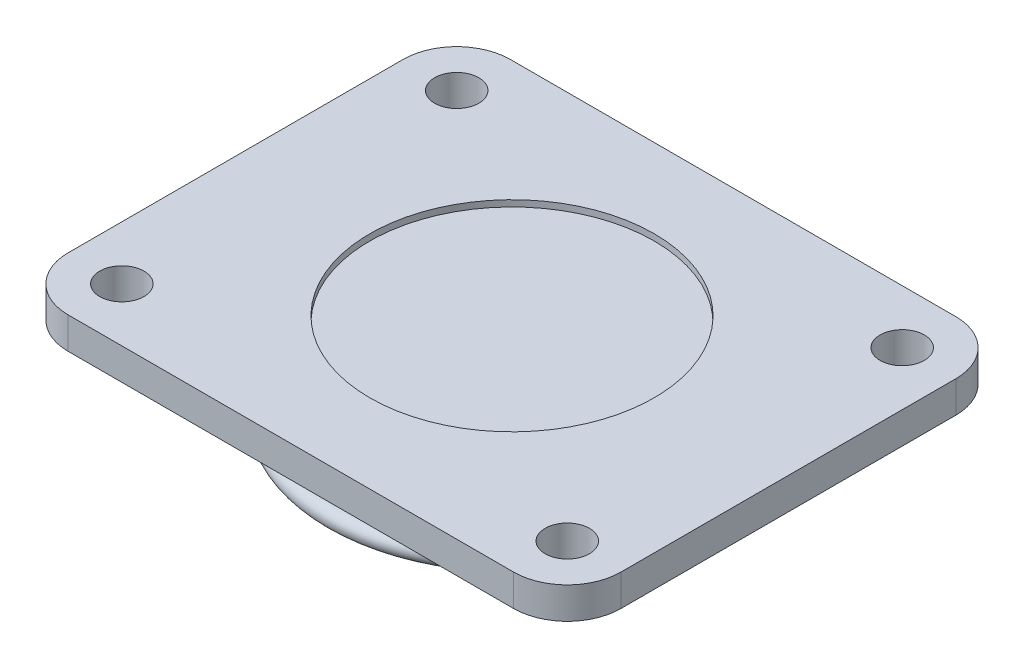
ISO-10303-21;
HEADER;
FILE_DESCRIPTION(('STEP AP214'),'2;1');
FILE_NAME('part.step','',(''),(''),'','','');
FILE_SCHEMA(('AUTOMOTIVE_DESIGN { 1 0 10303 214 1 1 1 1 }'));
ENDSEC;
DATA;
#1=APPLICATION_CONTEXT('core data for automotive mechanical design processes');
#2=APPLICATION_PROTOCOL_DEFINITION('international standard','automotive_design',2000,#1);
#3=PRODUCT_CONTEXT('',#1,'mechanical');
#4=PRODUCT('Part','Part','',(#3));
#5=PRODUCT_RELATED_PRODUCT_CATEGORY('part','',(#4));
#6=PRODUCT_DEFINITION_FORMATION('','',#4);
#7=PRODUCT_DEFINITION_CONTEXT('part definition',#1,'design');
#8=PRODUCT_DEFINITION('design','',#6,#7);
#9=PRODUCT_DEFINITION_SHAPE('','',#8);
#10=(LENGTH_UNIT() NAMED_UNIT(*) SI_UNIT(.MILLI.,.METRE.));
#11=(NAMED_UNIT(*) PLANE_ANGLE_UNIT() SI_UNIT($,.RADIAN.));
#12=(NAMED_UNIT(*) SI_UNIT($,.STERADIAN.) SOLID_ANGLE_UNIT());
#13=UNCERTAINTY_MEASURE_WITH_UNIT(LENGTH_MEASURE(1.E-05),#10,'distance_accuracy_value','');
#14=(GEOMETRIC_REPRESENTATION_CONTEXT(3) GLOBAL_UNCERTAINTY_ASSIGNED_CONTEXT((#13)) GLOBAL_UNIT_ASSIGNED_CONTEXT((#10,
#11,#12)) REPRESENTATION_CONTEXT('',''));
#15=CARTESIAN_POINT('',(0.,0.,0.));
#16=DIRECTION('',(0.,0.,1.));
#17=DIRECTION('',(1.,0.,0.));
#18=AXIS2_PLACEMENT_3D('',#15,#16,#17);
#19=CARTESIAN_POINT('',(13.1976,-0.267260409429404,-9.9216));
#20=DIRECTION('',(0.,-1.,0.));
#21=DIRECTION('',(0.,0.,-1.));
#22=AXIS2_PLACEMENT_3D('',#19,#20,#21);
#23=PLANE('',#22);
#24=CARTESIAN_POINT('',(0.,-0.267260409429404,0.));
#25=DIRECTION('',(0.,1.,0.));
#26=DIRECTION('',(0.,0.,1.));
#27=AXIS2_PLACEMENT_3D('',#24,#25,#26);
#28=CIRCLE('',#27,8.424);
#29=CARTESIAN_POINT('',(0.,-0.267260409429404,8.424));
#30=VERTEX_POINT('',#29);
#31=EDGE_CURVE('E289',#30,#30,#28,.T.);
#32=ORIENTED_EDGE('',*,*,#31,.F.);
#33=EDGE_LOOP('',(#32));
#34=FACE_BOUND('',#33,.T.);
#35=CARTESIAN_POINT('',(13.1976,-0.267260409429404,-9.9216));
#36=DIRECTION('',(0.,1.,0.));
#37=DIRECTION('',(0.,0.,-1.));
#38=AXIS2_PLACEMENT_3D('',#35,#36,#37);
#39=CIRCLE('',#38,3.1824);
#40=CARTESIAN_POINT('',(16.38,-0.267260409429404,-9.92159999999998));
#41=VERTEX_POINT('',#40);
#42=CARTESIAN_POINT('',(13.1976,-0.267260409429404,-13.104));
#43=VERTEX_POINT('',#42);
#44=EDGE_CURVE('E164',#41,#43,#39,.T.);
#45=ORIENTED_EDGE('',*,*,#44,.T.);
#46=DIRECTION('',(-1.,0.,0.));
#47=VECTOR('',#46,1.);
#48=CARTESIAN_POINT('',(-13.1976,-0.267260409429404,-13.104));
#49=LINE('',#48,#47);
#50=CARTESIAN_POINT('',(-13.1976,-0.267260409429404,-13.104));
#51=VERTEX_POINT('',#50);
#52=EDGE_CURVE('E112',#43,#51,#49,.T.);
#53=ORIENTED_EDGE('',*,*,#52,.T.);
#54=CARTESIAN_POINT('',(-13.1976,-0.267260409429404,-9.9216));
#55=DIRECTION('',(0.,1.,0.));
#56=DIRECTION('',(0.,0.,-1.));
#57=AXIS2_PLACEMENT_3D('',#54,#55,#56);
#58=CIRCLE('',#57,3.1824);
#59=CARTESIAN_POINT('',(-16.38,-0.267260409429404,-9.92159999999998));
#60=VERTEX_POINT('',#59);
#61=EDGE_CURVE('E245',#51,#60,#58,.T.);
#62=ORIENTED_EDGE('',*,*,#61,.T.);
#63=DIRECTION('',(0.,0.,1.));
#64=VECTOR('',#63,1.);
#65=CARTESIAN_POINT('',(-16.38,-0.267260409429404,9.92159999999998));
#66=LINE('',#65,#64);
#67=CARTESIAN_POINT('',(-16.38,-0.267260409429404,9.92159999999998));
#68=VERTEX_POINT('',#67);
#69=EDGE_CURVE('E247',#60,#68,#66,.T.);
#70=ORIENTED_EDGE('',*,*,#69,.T.);
#71=CARTESIAN_POINT('',(-13.1976,-0.267260409429404,9.9216));
#72=DIRECTION('',(0.,1.,0.));
#73=DIRECTION('',(0.,0.,-1.));
#74=AXIS2_PLACEMENT_3D('',#71,#72,#73);
#75=CIRCLE('',#74,3.1824);
#76=CARTESIAN_POINT('',(-13.1976,-0.267260409429404,13.104));
#77=VERTEX_POINT('',#76);
#78=EDGE_CURVE('E131',#68,#77,#75,.T.);
#79=ORIENTED_EDGE('',*,*,#78,.T.);
#80=DIRECTION('',(1.,0.,0.));
#81=VECTOR('',#80,1.);
#82=CARTESIAN_POINT('',(-13.1976,-0.267260409429404,13.104));
#83=LINE('',#82,#81);
#84=CARTESIAN_POINT('',(13.1976,-0.267260409429404,13.104));
#85=VERTEX_POINT('',#84);
#86=EDGE_CURVE('E125',#77,#85,#83,.T.);
#87=ORIENTED_EDGE('',*,*,#86,.T.);
#88=CARTESIAN_POINT('',(13.1976,-0.267260409429404,9.9216));
#89=DIRECTION('',(0.,1.,0.));
#90=DIRECTION('',(0.,0.,1.));
#91=AXIS2_PLACEMENT_3D('',#88,#89,#90);
#92=CIRCLE('',#91,3.1824);
#93=CARTESIAN_POINT('',(16.38,-0.267260409429404,9.92159999999998));
#94=VERTEX_POINT('',#93);
#95=EDGE_CURVE('E129',#85,#94,#92,.T.);
#96=ORIENTED_EDGE('',*,*,#95,.T.);
#97=DIRECTION('',(0.,0.,-1.));
#98=VECTOR('',#97,1.);
#99=CARTESIAN_POINT('',(16.38,-0.267260409429404,9.92159999999998));
#100=LINE('',#99,#98);
#101=EDGE_CURVE('E68',#94,#41,#100,.T.);
#102=ORIENTED_EDGE('',*,*,#101,.T.);
#103=EDGE_LOOP('',(#45,#53,#62,#70,#79,#87,#96,#102));
#104=FACE_BOUND('',#103,.T.);
#105=CARTESIAN_POINT('',(-13.1976,-0.267260409429404,-9.9216));
#106=DIRECTION('',(0.,1.,0.));
#107=DIRECTION('',(0.,0.,1.));
#108=AXIS2_PLACEMENT_3D('',#105,#106,#107);
#109=CIRCLE('',#108,1.3104);
#110=CARTESIAN_POINT('',(-13.1976,-0.267260409429404,-8.6112));
#111=VERTEX_POINT('',#110);
#112=EDGE_CURVE('E153',#111,#111,#109,.T.);
#113=ORIENTED_EDGE('',*,*,#112,.F.);
#114=EDGE_LOOP('',(#113));
#115=FACE_BOUND('',#114,.T.);
#116=CARTESIAN_POINT('',(-13.1976,-0.267260409429404,9.9216));
#117=DIRECTION('',(0.,1.,0.));
#118=DIRECTION('',(0.,0.,1.));
#119=AXIS2_PLACEMENT_3D('',#116,#117,#118);
#120=CIRCLE('',#119,1.3104);
#121=CARTESIAN_POINT('',(-13.1976,-0.267260409429404,11.232));
#122=VERTEX_POINT('',#121);
#123=EDGE_CURVE('E256',#122,#122,#120,.T.);
#124=ORIENTED_EDGE('',*,*,#123,.F.);
#125=EDGE_LOOP('',(#124));
#126=FACE_BOUND('',#125,.T.);
#127=CARTESIAN_POINT('',(13.1976,-0.267260409429404,9.9216));
#128=DIRECTION('',(0.,1.,0.));
#129=DIRECTION('',(0.,0.,1.));
#130=AXIS2_PLACEMENT_3D('',#127,#128,#129);
#131=CIRCLE('',#130,1.3104);
#132=CARTESIAN_POINT('',(13.1976,-0.267260409429404,11.232));
#133=VERTEX_POINT('',#132);
#134=EDGE_CURVE('E262',#133,#133,#131,.T.);
#135=ORIENTED_EDGE('',*,*,#134,.F.);
#136=EDGE_LOOP('',(#135));
#137=FACE_BOUND('',#136,.T.);
#138=CARTESIAN_POINT('',(13.1976,-0.267260409429404,-9.9216));
#139=DIRECTION('',(0.,1.,0.));
#140=DIRECTION('',(0.,0.,1.));
#141=AXIS2_PLACEMENT_3D('',#138,#139,#140);
#142=CIRCLE('',#141,1.3104);
#143=CARTESIAN_POINT('',(13.1976,-0.267260409429404,-8.6112));
#144=VERTEX_POINT('',#143);
#145=EDGE_CURVE('E268',#144,#144,#142,.T.);
#146=ORIENTED_EDGE('',*,*,#145,.F.);
#147=EDGE_LOOP('',(#146));
#148=FACE_BOUND('',#147,.T.);
#149=ADVANCED_FACE('F51',(#34,#104,#115,#126,#137,#148),#23,.F.);
#150=CARTESIAN_POINT('',(13.1976,-2.1392604094294,-9.9216));
#151=DIRECTION('',(0.,-1.,0.));
#152=DIRECTION('',(0.,0.,-1.));
#153=AXIS2_PLACEMENT_3D('',#150,#151,#152);
#154=PLANE('',#153);
#155=CARTESIAN_POINT('',(0.,-2.1392604094294,0.));
#156=DIRECTION('',(0.,-1.,0.));
#157=DIRECTION('',(0.,0.,-1.));
#158=AXIS2_PLACEMENT_3D('',#155,#156,#157);
#159=CIRCLE('',#158,10.4832);
#160=CARTESIAN_POINT('',(0.,-2.1392604094294,-10.4832));
#161=VERTEX_POINT('',#160);
#162=EDGE_CURVE('E274',#161,#161,#159,.T.);
#163=ORIENTED_EDGE('',*,*,#162,.F.);
#164=EDGE_LOOP('',(#163));
#165=FACE_BOUND('',#164,.T.);
#166=CARTESIAN_POINT('',(13.1976,-2.1392604094294,9.9216));
#167=DIRECTION('',(0.,1.,0.));
#168=DIRECTION('',(0.,0.,1.));
#169=AXIS2_PLACEMENT_3D('',#166,#167,#168);
#170=CIRCLE('',#169,1.3104);
#171=CARTESIAN_POINT('',(13.1976,-2.1392604094294,11.232));
#172=VERTEX_POINT('',#171);
#173=EDGE_CURVE('E265',#172,#172,#170,.T.);
#174=ORIENTED_EDGE('',*,*,#173,.T.);
#175=EDGE_LOOP('',(#174));
#176=FACE_BOUND('',#175,.T.);
#177=CARTESIAN_POINT('',(-13.1976,-2.1392604094294,-9.9216));
#178=DIRECTION('',(0.,1.,0.));
#179=DIRECTION('',(0.,0.,1.));
#180=AXIS2_PLACEMENT_3D('',#177,#178,#179);
#181=CIRCLE('',#180,1.3104);
#182=CARTESIAN_POINT('',(-13.1976,-2.1392604094294,-8.6112));
#183=VERTEX_POINT('',#182);
#184=EDGE_CURVE('E253',#183,#183,#181,.T.);
#185=ORIENTED_EDGE('',*,*,#184,.T.);
#186=EDGE_LOOP('',(#185));
#187=FACE_BOUND('',#186,.T.);
#188=CARTESIAN_POINT('',(13.1976,-2.1392604094294,-9.9216));
#189=DIRECTION('',(0.,1.,0.));
#190=DIRECTION('',(0.,0.,-1.));
#191=AXIS2_PLACEMENT_3D('',#188,#189,#190);
#192=CIRCLE('',#191,3.1824);
#193=CARTESIAN_POINT('',(16.38,-2.1392604094294,-9.92159999999998));
#194=VERTEX_POINT('',#193);
#195=CARTESIAN_POINT('',(13.1976,-2.1392604094294,-13.104));
#196=VERTEX_POINT('',#195);
#197=EDGE_CURVE('E149',#194,#196,#192,.T.);
#198=ORIENTED_EDGE('',*,*,#197,.F.);
#199=DIRECTION('',(0.,0.,-1.));
#200=VECTOR('',#199,1.);
#201=CARTESIAN_POINT('',(16.38,-2.1392604094294,9.92159999999998));
#202=LINE('',#201,#200);
#203=CARTESIAN_POINT('',(16.38,-2.1392604094294,9.92159999999998));
#204=VERTEX_POINT('',#203);
#205=EDGE_CURVE('E103',#204,#194,#202,.T.);
#206=ORIENTED_EDGE('',*,*,#205,.F.);
#207=CARTESIAN_POINT('',(13.1976,-2.1392604094294,9.9216));
#208=DIRECTION('',(0.,1.,0.));
#209=DIRECTION('',(0.,0.,1.));
#210=AXIS2_PLACEMENT_3D('',#207,#208,#209);
#211=CIRCLE('',#210,3.1824);
#212=CARTESIAN_POINT('',(13.1976,-2.1392604094294,13.104));
#213=VERTEX_POINT('',#212);
#214=EDGE_CURVE('E97',#213,#204,#211,.T.);
#215=ORIENTED_EDGE('',*,*,#214,.F.);
#216=DIRECTION('',(1.,0.,0.));
#217=VECTOR('',#216,1.);
#218=CARTESIAN_POINT('',(-13.1976,-2.1392604094294,13.104));
#219=LINE('',#218,#217);
#220=CARTESIAN_POINT('',(-13.1976,-2.1392604094294,13.104));
#221=VERTEX_POINT('',#220);
#222=EDGE_CURVE('E139',#221,#213,#219,.T.);
#223=ORIENTED_EDGE('',*,*,#222,.F.);
#224=CARTESIAN_POINT('',(-13.1976,-2.1392604094294,9.9216));
#225=DIRECTION('',(0.,1.,0.));
#226=DIRECTION('',(0.,0.,-1.));
#227=AXIS2_PLACEMENT_3D('',#224,#225,#226);
#228=CIRCLE('',#227,3.1824);
#229=CARTESIAN_POINT('',(-16.38,-2.1392604094294,9.92159999999998));
#230=VERTEX_POINT('',#229);
#231=EDGE_CURVE('E159',#230,#221,#228,.T.);
#232=ORIENTED_EDGE('',*,*,#231,.F.);
#233=DIRECTION('',(0.,0.,1.));
#234=VECTOR('',#233,1.);
#235=CARTESIAN_POINT('',(-16.38,-2.1392604094294,9.92159999999998));
#236=LINE('',#235,#234);
#237=CARTESIAN_POINT('',(-16.38,-2.1392604094294,-9.92159999999998));
#238=VERTEX_POINT('',#237);
#239=EDGE_CURVE('E157',#238,#230,#236,.T.);
#240=ORIENTED_EDGE('',*,*,#239,.F.);
#241=CARTESIAN_POINT('',(-13.1976,-2.1392604094294,-9.9216));
#242=DIRECTION('',(0.,1.,0.));
#243=DIRECTION('',(0.,0.,-1.));
#244=AXIS2_PLACEMENT_3D('',#241,#242,#243);
#245=CIRCLE('',#244,3.1824);
#246=CARTESIAN_POINT('',(-13.1976,-2.1392604094294,-13.104));
#247=VERTEX_POINT('',#246);
#248=EDGE_CURVE('E155',#247,#238,#245,.T.);
#249=ORIENTED_EDGE('',*,*,#248,.F.);
#250=DIRECTION('',(-1.,0.,0.));
#251=VECTOR('',#250,1.);
#252=CARTESIAN_POINT('',(-13.1976,-2.1392604094294,-13.104));
#253=LINE('',#252,#251);
#254=EDGE_CURVE('E152',#196,#247,#253,.T.);
#255=ORIENTED_EDGE('',*,*,#254,.F.);
#256=EDGE_LOOP('',(#198,#206,#215,#223,#232,#240,#249,#255));
#257=FACE_BOUND('',#256,.T.);
#258=CARTESIAN_POINT('',(-13.1976,-2.1392604094294,9.9216));
#259=DIRECTION('',(0.,1.,0.));
#260=DIRECTION('',(0.,0.,1.));
#261=AXIS2_PLACEMENT_3D('',#258,#259,#260);
#262=CIRCLE('',#261,1.3104);
#263=CARTESIAN_POINT('',(-13.1976,-2.1392604094294,11.232));
#264=VERTEX_POINT('',#263);
#265=EDGE_CURVE('E259',#264,#264,#262,.T.);
#266=ORIENTED_EDGE('',*,*,#265,.T.);
#267=EDGE_LOOP('',(#266));
#268=FACE_BOUND('',#267,.T.);
#269=CARTESIAN_POINT('',(13.1976,-2.1392604094294,-9.9216));
#270=DIRECTION('',(0.,1.,0.));
#271=DIRECTION('',(0.,0.,1.));
#272=AXIS2_PLACEMENT_3D('',#269,#270,#271);
#273=CIRCLE('',#272,1.3104);
#274=CARTESIAN_POINT('',(13.1976,-2.1392604094294,-8.6112));
#275=VERTEX_POINT('',#274);
#276=EDGE_CURVE('E271',#275,#275,#273,.T.);
#277=ORIENTED_EDGE('',*,*,#276,.T.);
#278=EDGE_LOOP('',(#277));
#279=FACE_BOUND('',#278,.T.);
#280=ADVANCED_FACE('F197',(#165,#176,#187,#257,#268,#279),#154,.T.);
#281=CARTESIAN_POINT('',(13.1976,-0.267260409429404,-9.9216));
#282=DIRECTION('',(0.,-1.,0.));
#283=DIRECTION('',(0.,0.,-1.));
#284=AXIS2_PLACEMENT_3D('',#281,#282,#283);
#285=CYLINDRICAL_SURFACE('',#284,3.1824);
#286=ORIENTED_EDGE('',*,*,#197,.T.);
#287=DIRECTION('',(0.,-1.,0.));
#288=VECTOR('',#287,1.);
#289=CARTESIAN_POINT('',(13.1976,-0.267260409429404,-13.104));
#290=LINE('',#289,#288);
#291=EDGE_CURVE('E177',#43,#196,#290,.T.);
#292=ORIENTED_EDGE('',*,*,#291,.F.);
#293=ORIENTED_EDGE('',*,*,#44,.F.);
#294=DIRECTION('',(0.,-1.,0.));
#295=VECTOR('',#294,1.);
#296=CARTESIAN_POINT('',(16.38,-0.267260409429404,-9.92159999999998));
#297=LINE('',#296,#295);
#298=EDGE_CURVE('E145',#41,#194,#297,.T.);
#299=ORIENTED_EDGE('',*,*,#298,.T.);
#300=EDGE_LOOP('',(#286,#292,#293,#299));
#301=FACE_BOUND('',#300,.T.);
#302=ADVANCED_FACE('F203',(#301),#285,.T.);
#303=CARTESIAN_POINT('',(-13.1976,-0.267260409429404,-13.104));
#304=DIRECTION('',(0.,0.,1.));
#305=DIRECTION('',(1.,0.,0.));
#306=AXIS2_PLACEMENT_3D('',#303,#304,#305);
#307=PLANE('',#306);
#308=ORIENTED_EDGE('',*,*,#254,.T.);
#309=DIRECTION('',(0.,-1.,0.));
#310=VECTOR('',#309,1.);
#311=CARTESIAN_POINT('',(-13.1976,-0.267260409429404,-13.104));
#312=LINE('',#311,#310);
#313=EDGE_CURVE('E174',#51,#247,#312,.T.);
#314=ORIENTED_EDGE('',*,*,#313,.F.);
#315=ORIENTED_EDGE('',*,*,#52,.F.);
#316=ORIENTED_EDGE('',*,*,#291,.T.);
#317=EDGE_LOOP('',(#308,#314,#315,#316));
#318=FACE_BOUND('',#317,.T.);
#319=ADVANCED_FACE('F229',(#318),#307,.F.);
#320=CARTESIAN_POINT('',(-13.1976,-0.267260409429404,-9.9216));
#321=DIRECTION('',(0.,-1.,0.));
#322=DIRECTION('',(0.,0.,-1.));
#323=AXIS2_PLACEMENT_3D('',#320,#321,#322);
#324=CYLINDRICAL_SURFACE('',#323,3.1824);
#325=ORIENTED_EDGE('',*,*,#248,.T.);
#326=DIRECTION('',(0.,-1.,0.));
#327=VECTOR('',#326,1.);
#328=CARTESIAN_POINT('',(-16.38,-0.267260409429404,-9.92159999999998));
#329=LINE('',#328,#327);
#330=EDGE_CURVE('E171',#60,#238,#329,.T.);
#331=ORIENTED_EDGE('',*,*,#330,.F.);
#332=ORIENTED_EDGE('',*,*,#61,.F.);
#333=ORIENTED_EDGE('',*,*,#313,.T.);
#334=EDGE_LOOP('',(#325,#331,#332,#333));
#335=FACE_BOUND('',#334,.T.);
#336=ADVANCED_FACE('F225',(#335),#324,.T.);
#337=CARTESIAN_POINT('',(-16.38,-0.267260409429404,9.92159999999998));
#338=DIRECTION('',(1.,0.,0.));
#339=DIRECTION('',(0.,0.,-1.));
#340=AXIS2_PLACEMENT_3D('',#337,#338,#339);
#341=PLANE('',#340);
#342=ORIENTED_EDGE('',*,*,#239,.T.);
#343=DIRECTION('',(0.,-1.,0.));
#344=VECTOR('',#343,1.);
#345=CARTESIAN_POINT('',(-16.38,-0.267260409429404,9.92159999999998));
#346=LINE('',#345,#344);
#347=EDGE_CURVE('E168',#68,#230,#346,.T.);
#348=ORIENTED_EDGE('',*,*,#347,.F.);
#349=ORIENTED_EDGE('',*,*,#69,.F.);
#350=ORIENTED_EDGE('',*,*,#330,.T.);
#351=EDGE_LOOP('',(#342,#348,#349,#350));
#352=FACE_BOUND('',#351,.T.);
#353=ADVANCED_FACE('F221',(#352),#341,.F.);
#354=CARTESIAN_POINT('',(-13.1976,-0.267260409429404,9.9216));
#355=DIRECTION('',(0.,-1.,0.));
#356=DIRECTION('',(0.,0.,-1.));
#357=AXIS2_PLACEMENT_3D('',#354,#355,#356);
#358=CYLINDRICAL_SURFACE('',#357,3.1824);
#359=ORIENTED_EDGE('',*,*,#231,.T.);
#360=DIRECTION('',(0.,-1.,0.));
#361=VECTOR('',#360,1.);
#362=CARTESIAN_POINT('',(-13.1976,-0.267260409429404,13.104));
#363=LINE('',#362,#361);
#364=EDGE_CURVE('E140',#77,#221,#363,.T.);
#365=ORIENTED_EDGE('',*,*,#364,.F.);
#366=ORIENTED_EDGE('',*,*,#78,.F.);
#367=ORIENTED_EDGE('',*,*,#347,.T.);
#368=EDGE_LOOP('',(#359,#365,#366,#367));
#369=FACE_BOUND('',#368,.T.);
#370=ADVANCED_FACE('F218',(#369),#358,.T.);
#371=CARTESIAN_POINT('',(-13.1976,-0.267260409429404,13.104));
#372=DIRECTION('',(0.,0.,-1.));
#373=DIRECTION('',(-1.,0.,0.));
#374=AXIS2_PLACEMENT_3D('',#371,#372,#373);
#375=PLANE('',#374);
#376=ORIENTED_EDGE('',*,*,#222,.T.);
#377=DIRECTION('',(0.,-1.,0.));
#378=VECTOR('',#377,1.);
#379=CARTESIAN_POINT('',(13.1976,-0.267260409429404,13.104));
#380=LINE('',#379,#378);
#381=EDGE_CURVE('E136',#85,#213,#380,.T.);
#382=ORIENTED_EDGE('',*,*,#381,.F.);
#383=ORIENTED_EDGE('',*,*,#86,.F.);
#384=ORIENTED_EDGE('',*,*,#364,.T.);
#385=EDGE_LOOP('',(#376,#382,#383,#384));
#386=FACE_BOUND('',#385,.T.);
#387=ADVANCED_FACE('F137',(#386),#375,.F.);
#388=CARTESIAN_POINT('',(13.1976,-0.267260409429404,9.9216));
#389=DIRECTION('',(0.,-1.,0.));
#390=DIRECTION('',(0.,0.,-1.));
#391=AXIS2_PLACEMENT_3D('',#388,#389,#390);
#392=CYLINDRICAL_SURFACE('',#391,3.1824);
#393=ORIENTED_EDGE('',*,*,#214,.T.);
#394=DIRECTION('',(0.,-1.,0.));
#395=VECTOR('',#394,1.);
#396=CARTESIAN_POINT('',(16.38,-0.267260409429404,9.92159999999998));
#397=LINE('',#396,#395);
#398=EDGE_CURVE('E141',#94,#204,#397,.T.);
#399=ORIENTED_EDGE('',*,*,#398,.F.);
#400=ORIENTED_EDGE('',*,*,#95,.F.);
#401=ORIENTED_EDGE('',*,*,#381,.T.);
#402=EDGE_LOOP('',(#393,#399,#400,#401));
#403=FACE_BOUND('',#402,.T.);
#404=ADVANCED_FACE('F143',(#403),#392,.T.);
#405=CARTESIAN_POINT('',(16.38,-0.267260409429404,9.92159999999998));
#406=DIRECTION('',(-1.,0.,0.));
#407=DIRECTION('',(0.,0.,1.));
#408=AXIS2_PLACEMENT_3D('',#405,#406,#407);
#409=PLANE('',#408);
#410=ORIENTED_EDGE('',*,*,#205,.T.);
#411=ORIENTED_EDGE('',*,*,#298,.F.);
#412=ORIENTED_EDGE('',*,*,#101,.F.);
#413=ORIENTED_EDGE('',*,*,#398,.T.);
#414=EDGE_LOOP('',(#410,#411,#412,#413));
#415=FACE_BOUND('',#414,.T.);
#416=ADVANCED_FACE('F211',(#415),#409,.F.);
#417=CARTESIAN_POINT('',(-13.1976,-0.267260409429404,-9.9216));
#418=DIRECTION('',(0.,-1.,0.));
#419=DIRECTION('',(0.,0.,-1.));
#420=AXIS2_PLACEMENT_3D('',#417,#418,#419);
#421=CYLINDRICAL_SURFACE('',#420,1.3104);
#422=ORIENTED_EDGE('',*,*,#112,.T.);
#423=EDGE_LOOP('',(#422));
#424=FACE_BOUND('',#423,.T.);
#425=ORIENTED_EDGE('',*,*,#184,.F.);
#426=EDGE_LOOP('',(#425));
#427=FACE_BOUND('',#426,.T.);
#428=ADVANCED_FACE('F208',(#424,#427),#421,.F.);
#429=CARTESIAN_POINT('',(-13.1976,-0.267260409429404,9.9216));
#430=DIRECTION('',(0.,-1.,0.));
#431=DIRECTION('',(0.,0.,-1.));
#432=AXIS2_PLACEMENT_3D('',#429,#430,#431);
#433=CYLINDRICAL_SURFACE('',#432,1.3104);
#434=ORIENTED_EDGE('',*,*,#123,.T.);
#435=EDGE_LOOP('',(#434));
#436=FACE_BOUND('',#435,.T.);
#437=ORIENTED_EDGE('',*,*,#265,.F.);
#438=EDGE_LOOP('',(#437));
#439=FACE_BOUND('',#438,.T.);
#440=ADVANCED_FACE('F322',(#436,#439),#433,.F.);
#441=CARTESIAN_POINT('',(13.1976,-0.267260409429404,9.9216));
#442=DIRECTION('',(0.,-1.,0.));
#443=DIRECTION('',(0.,0.,-1.));
#444=AXIS2_PLACEMENT_3D('',#441,#442,#443);
#445=CYLINDRICAL_SURFACE('',#444,1.3104);
#446=ORIENTED_EDGE('',*,*,#134,.T.);
#447=EDGE_LOOP('',(#446));
#448=FACE_BOUND('',#447,.T.);
#449=ORIENTED_EDGE('',*,*,#173,.F.);
#450=EDGE_LOOP('',(#449));
#451=FACE_BOUND('',#450,.T.);
#452=ADVANCED_FACE('F319',(#448,#451),#445,.F.);
#453=CARTESIAN_POINT('',(13.1976,-0.267260409429404,-9.9216));
#454=DIRECTION('',(0.,-1.,0.));
#455=DIRECTION('',(0.,0.,-1.));
#456=AXIS2_PLACEMENT_3D('',#453,#454,#455);
#457=CYLINDRICAL_SURFACE('',#456,1.3104);
#458=ORIENTED_EDGE('',*,*,#145,.T.);
#459=EDGE_LOOP('',(#458));
#460=FACE_BOUND('',#459,.T.);
#461=ORIENTED_EDGE('',*,*,#276,.F.);
#462=EDGE_LOOP('',(#461));
#463=FACE_BOUND('',#462,.T.);
#464=ADVANCED_FACE('F315',(#460,#463),#457,.F.);
#465=CARTESIAN_POINT('',(0.,-5.8832604094294,0.));
#466=DIRECTION('',(0.,1.,0.));
#467=DIRECTION('',(0.,0.,1.));
#468=AXIS2_PLACEMENT_3D('',#465,#466,#467);
#469=CYLINDRICAL_SURFACE('',#468,10.4832);
#470=CARTESIAN_POINT('',(0.,-4.7600604094294,0.));
#471=DIRECTION('',(0.,-1.,0.));
#472=DIRECTION('',(0.,0.,-1.));
#473=AXIS2_PLACEMENT_3D('',#470,#471,#472);
#474=CIRCLE('',#473,10.4832);
#475=CARTESIAN_POINT('',(0.,-4.7600604094294,-10.4832));
#476=VERTEX_POINT('',#475);
#477=EDGE_CURVE('E279',#476,#476,#474,.F.);
#478=ORIENTED_EDGE('',*,*,#477,.T.);
#479=EDGE_LOOP('',(#478));
#480=FACE_BOUND('',#479,.T.);
#481=ORIENTED_EDGE('',*,*,#162,.T.);
#482=EDGE_LOOP('',(#481));
#483=FACE_BOUND('',#482,.T.);
#484=ADVANCED_FACE('F308',(#480,#483),#469,.T.);
#485=CARTESIAN_POINT('',(0.,-5.3216604094294,0.));
#486=DIRECTION('',(0.,1.,0.));
#487=DIRECTION('',(0.,0.,1.));
#488=AXIS2_PLACEMENT_3D('',#485,#486,#487);
#489=TOROIDAL_SURFACE('',#488,10.4832,0.5616);
#490=CARTESIAN_POINT('',(0.,-5.8832604094294,0.));
#491=DIRECTION('',(0.,1.,0.));
#492=DIRECTION('',(0.,0.,1.));
#493=AXIS2_PLACEMENT_3D('',#490,#491,#492);
#494=CIRCLE('',#493,10.4832);
#495=CARTESIAN_POINT('',(0.,-5.8832604094294,10.4832));
#496=VERTEX_POINT('',#495);
#497=EDGE_CURVE('E282',#496,#496,#494,.T.);
#498=ORIENTED_EDGE('',*,*,#497,.T.);
#499=EDGE_LOOP('',(#498));
#500=FACE_BOUND('',#499,.T.);
#501=ORIENTED_EDGE('',*,*,#477,.F.);
#502=EDGE_LOOP('',(#501));
#503=FACE_BOUND('',#502,.T.);
#504=ADVANCED_FACE('F305',(#500,#503),#489,.T.);
#505=CARTESIAN_POINT('',(0.,-5.8832604094294,0.));
#506=DIRECTION('',(0.,-1.,0.));
#507=DIRECTION('',(0.,0.,-1.));
#508=AXIS2_PLACEMENT_3D('',#505,#506,#507);
#509=PLANE('',#508);
#510=CARTESIAN_POINT('',(0.,-5.8832604094294,0.));
#511=DIRECTION('',(0.,-1.,0.));
#512=DIRECTION('',(0.,0.,-1.));
#513=AXIS2_PLACEMENT_3D('',#510,#511,#512);
#514=CIRCLE('',#513,1.404);
#515=CARTESIAN_POINT('',(0.,-5.8832604094294,-1.404));
#516=VERTEX_POINT('',#515);
#517=EDGE_CURVE('E285',#516,#516,#514,.T.);
#518=ORIENTED_EDGE('',*,*,#517,.F.);
#519=EDGE_LOOP('',(#518));
#520=FACE_BOUND('',#519,.T.);
#521=ORIENTED_EDGE('',*,*,#497,.F.);
#522=EDGE_LOOP('',(#521));
#523=FACE_BOUND('',#522,.T.);
#524=ADVANCED_FACE('F303',(#520,#523),#509,.T.);
#525=CARTESIAN_POINT('',(0.,-10.5632604094294,0.));
#526=DIRECTION('',(0.,1.,0.));
#527=DIRECTION('',(0.,0.,1.));
#528=AXIS2_PLACEMENT_3D('',#525,#526,#527);
#529=CYLINDRICAL_SURFACE('',#528,1.404);
#530=CARTESIAN_POINT('',(0.,-10.3760604094294,0.));
#531=DIRECTION('',(0.,-1.,0.));
#532=DIRECTION('',(0.,0.,-1.));
#533=AXIS2_PLACEMENT_3D('',#530,#531,#532);
#534=CIRCLE('',#533,1.404);
#535=CARTESIAN_POINT('',(0.,-10.3760604094294,-1.404));
#536=VERTEX_POINT('',#535);
#537=EDGE_CURVE('E11',#536,#536,#534,.F.);
#538=ORIENTED_EDGE('',*,*,#537,.T.);
#539=EDGE_LOOP('',(#538));
#540=FACE_BOUND('',#539,.T.);
#541=ORIENTED_EDGE('',*,*,#517,.T.);
#542=EDGE_LOOP('',(#541));
#543=FACE_BOUND('',#542,.T.);
#544=ADVANCED_FACE('F193',(#540,#543),#529,.T.);
#545=CARTESIAN_POINT('',(0.,-10.5632604094294,0.));
#546=DIRECTION('',(0.,-1.,0.));
#547=DIRECTION('',(0.,0.,-1.));
#548=AXIS2_PLACEMENT_3D('',#545,#546,#547);
#549=PLANE('',#548);
#550=CARTESIAN_POINT('',(0.,-10.5632604094294,0.));
#551=DIRECTION('',(0.,-1.,0.));
#552=DIRECTION('',(0.,0.,-1.));
#553=AXIS2_PLACEMENT_3D('',#550,#551,#552);
#554=CIRCLE('',#553,1.2168);
#555=CARTESIAN_POINT('',(0.,-10.5632604094294,-1.2168));
#556=VERTEX_POINT('',#555);
#557=EDGE_CURVE('E60',#556,#556,#554,.T.);
#558=ORIENTED_EDGE('',*,*,#557,.T.);
#559=EDGE_LOOP('',(#558));
#560=FACE_BOUND('',#559,.T.);
#561=ADVANCED_FACE('F181',(#560),#549,.T.);
#562=CARTESIAN_POINT('',(0.,-10.5632604094294,0.));
#563=DIRECTION('',(0.,1.,0.));
#564=DIRECTION('',(0.,0.,1.));
#565=AXIS2_PLACEMENT_3D('',#562,#563,#564);
#566=CONICAL_SURFACE('',#565,1.2168,0.785398163397435);
#567=ORIENTED_EDGE('',*,*,#537,.F.);
#568=EDGE_LOOP('',(#567));
#569=FACE_BOUND('',#568,.T.);
#570=ORIENTED_EDGE('',*,*,#557,.F.);
#571=EDGE_LOOP('',(#570));
#572=FACE_BOUND('',#571,.T.);
#573=ADVANCED_FACE('F53',(#569,#572),#566,.T.);
#574=CARTESIAN_POINT('',(0.,-0.641660409429404,0.));
#575=DIRECTION('',(0.,1.,0.));
#576=DIRECTION('',(0.,0.,1.));
#577=AXIS2_PLACEMENT_3D('',#574,#575,#576);
#578=CYLINDRICAL_SURFACE('',#577,8.424);
#579=CARTESIAN_POINT('',(0.,-0.641660409429404,0.));
#580=DIRECTION('',(0.,1.,0.));
#581=DIRECTION('',(0.,0.,1.));
#582=AXIS2_PLACEMENT_3D('',#579,#580,#581);
#583=CIRCLE('',#582,8.424);
#584=CARTESIAN_POINT('',(0.,-0.641660409429404,8.424));
#585=VERTEX_POINT('',#584);
#586=EDGE_CURVE('E288',#585,#585,#583,.T.);
#587=ORIENTED_EDGE('',*,*,#586,.F.);
#588=EDGE_LOOP('',(#587));
#589=FACE_BOUND('',#588,.T.);
#590=ORIENTED_EDGE('',*,*,#31,.T.);
#591=EDGE_LOOP('',(#590));
#592=FACE_BOUND('',#591,.T.);
#593=ADVANCED_FACE('F184',(#589,#592),#578,.F.);
#594=CARTESIAN_POINT('',(0.,-0.641660409429404,0.));
#595=DIRECTION('',(0.,1.,0.));
#596=DIRECTION('',(0.,0.,1.));
#597=AXIS2_PLACEMENT_3D('',#594,#595,#596);
#598=PLANE('',#597);
#599=ORIENTED_EDGE('',*,*,#586,.T.);
#600=EDGE_LOOP('',(#599));
#601=FACE_BOUND('',#600,.T.);
#602=ADVANCED_FACE('F190',(#601),#598,.T.);
#603=CLOSED_SHELL('',(#149,#280,#302,#319,#336,#353,#370,#387,#404,#416,#428,#440,#452,#464,
#484,#504,#524,#544,#561,#573,#593,#602));
#604=MANIFOLD_SOLID_BREP('B2',#603);
#605=ADVANCED_BREP_SHAPE_REPRESENTATION('',(#18,#604),#14);
#606=SHAPE_DEFINITION_REPRESENTATION(#9,#605);
ENDSEC;
END-ISO-10303-21;
